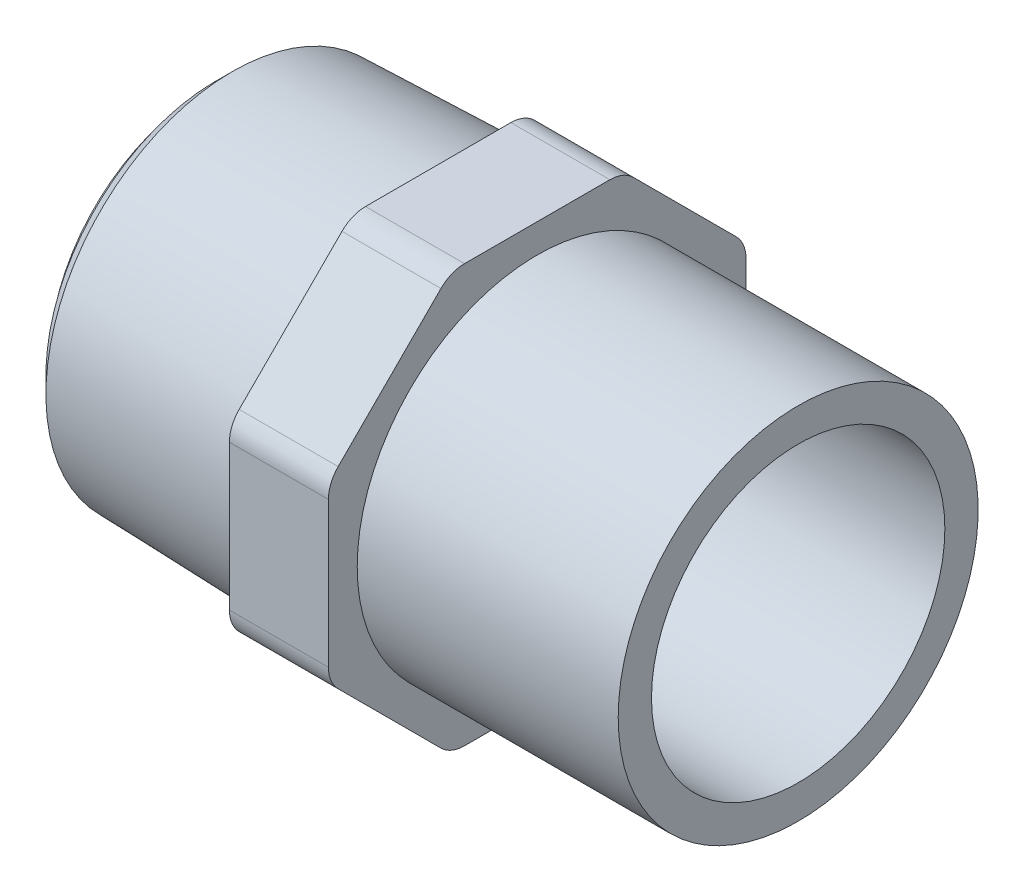
ISO-10303-21;
HEADER;
FILE_DESCRIPTION(('STEP AP214'),'2;1');
FILE_NAME('part.step','',(''),(''),'','','');
FILE_SCHEMA(('AUTOMOTIVE_DESIGN { 1 0 10303 214 1 1 1 1 }'));
ENDSEC;
DATA;
#1=APPLICATION_CONTEXT('core data for automotive mechanical design processes');
#2=APPLICATION_PROTOCOL_DEFINITION('international standard','automotive_design',2000,#1);
#3=PRODUCT_CONTEXT('',#1,'mechanical');
#4=PRODUCT('Part','Part','',(#3));
#5=PRODUCT_RELATED_PRODUCT_CATEGORY('part','',(#4));
#6=PRODUCT_DEFINITION_FORMATION('','',#4);
#7=PRODUCT_DEFINITION_CONTEXT('part definition',#1,'design');
#8=PRODUCT_DEFINITION('design','',#6,#7);
#9=PRODUCT_DEFINITION_SHAPE('','',#8);
#10=(LENGTH_UNIT() NAMED_UNIT(*) SI_UNIT(.MILLI.,.METRE.));
#11=(NAMED_UNIT(*) PLANE_ANGLE_UNIT() SI_UNIT($,.RADIAN.));
#12=(NAMED_UNIT(*) SI_UNIT($,.STERADIAN.) SOLID_ANGLE_UNIT());
#13=UNCERTAINTY_MEASURE_WITH_UNIT(LENGTH_MEASURE(1.E-05),#10,'distance_accuracy_value','');
#14=(GEOMETRIC_REPRESENTATION_CONTEXT(3) GLOBAL_UNCERTAINTY_ASSIGNED_CONTEXT((#13)) GLOBAL_UNIT_ASSIGNED_CONTEXT((#10,
#11,#12)) REPRESENTATION_CONTEXT('',''));
#15=CARTESIAN_POINT('',(0.,0.,0.));
#16=DIRECTION('',(0.,0.,1.));
#17=DIRECTION('',(1.,0.,0.));
#18=AXIS2_PLACEMENT_3D('',#15,#16,#17);
#19=CARTESIAN_POINT('',(-40.,-23.2,23.2));
#20=DIRECTION('',(-1.,0.,0.));
#21=DIRECTION('',(0.,1.,0.));
#22=AXIS2_PLACEMENT_3D('',#19,#20,#21);
#23=PLANE('',#22);
#24=CARTESIAN_POINT('',(-40.,0.,0.));
#25=DIRECTION('',(1.,0.,0.));
#26=DIRECTION('',(0.,0.,-1.));
#27=AXIS2_PLACEMENT_3D('',#24,#25,#26);
#28=CIRCLE('',#27,21.4293244783966);
#29=CARTESIAN_POINT('',(-40.,0.,-21.4293244783966));
#30=VERTEX_POINT('',#29);
#31=EDGE_CURVE('E18',#30,#30,#28,.F.);
#32=ORIENTED_EDGE('',*,*,#31,.F.);
#33=EDGE_LOOP('',(#32));
#34=FACE_BOUND('',#33,.T.);
#35=CARTESIAN_POINT('',(-40.,-19.5,8.07716446627534));
#36=DIRECTION('',(1.,0.,0.));
#37=DIRECTION('',(0.,0.,-1.));
#38=AXIS2_PLACEMENT_3D('',#35,#36,#37);
#39=CIRCLE('',#38,3.69999999999999);
#40=CARTESIAN_POINT('',(-40.,-22.1162950903902,10.6934595566656));
#41=VERTEX_POINT('',#40);
#42=CARTESIAN_POINT('',(-40.,-23.2,8.07716446627534));
#43=VERTEX_POINT('',#42);
#44=EDGE_CURVE('E235',#41,#43,#39,.T.);
#45=ORIENTED_EDGE('',*,*,#44,.F.);
#46=DIRECTION('',(0.,-0.707106781186547,-0.707106781186548));
#47=VECTOR('',#46,1.);
#48=CARTESIAN_POINT('',(-40.,-16.4048773235279,16.4048773235279));
#49=LINE('',#48,#47);
#50=CARTESIAN_POINT('',(-40.,-10.6934595566656,22.1162950903902));
#51=VERTEX_POINT('',#50);
#52=EDGE_CURVE('E132',#51,#41,#49,.T.);
#53=ORIENTED_EDGE('',*,*,#52,.F.);
#54=CARTESIAN_POINT('',(-40.,-8.07716446627536,19.5));
#55=DIRECTION('',(1.,0.,0.));
#56=DIRECTION('',(0.,0.,-1.));
#57=AXIS2_PLACEMENT_3D('',#54,#55,#56);
#58=CIRCLE('',#57,3.7);
#59=CARTESIAN_POINT('',(-40.,-8.07716446627536,23.2));
#60=VERTEX_POINT('',#59);
#61=EDGE_CURVE('E126',#60,#51,#58,.T.);
#62=ORIENTED_EDGE('',*,*,#61,.F.);
#63=DIRECTION('',(0.,-1.,0.));
#64=VECTOR('',#63,1.);
#65=CARTESIAN_POINT('',(-40.,0.,23.2));
#66=LINE('',#65,#64);
#67=CARTESIAN_POINT('',(-40.,8.07716446627536,23.2));
#68=VERTEX_POINT('',#67);
#69=EDGE_CURVE('E131',#68,#60,#66,.T.);
#70=ORIENTED_EDGE('',*,*,#69,.F.);
#71=CARTESIAN_POINT('',(-40.,8.07716446627537,19.5));
#72=DIRECTION('',(1.,0.,0.));
#73=DIRECTION('',(0.,0.,-1.));
#74=AXIS2_PLACEMENT_3D('',#71,#72,#73);
#75=CIRCLE('',#74,3.69999999999998);
#76=CARTESIAN_POINT('',(-40.,10.6934595566656,22.1162950903902));
#77=VERTEX_POINT('',#76);
#78=EDGE_CURVE('E147',#77,#68,#75,.T.);
#79=ORIENTED_EDGE('',*,*,#78,.F.);
#80=DIRECTION('',(0.,-0.707106781186548,0.707106781186548));
#81=VECTOR('',#80,1.);
#82=CARTESIAN_POINT('',(-40.,16.4048773235279,16.4048773235279));
#83=LINE('',#82,#81);
#84=CARTESIAN_POINT('',(-40.,22.1162950903902,10.6934595566656));
#85=VERTEX_POINT('',#84);
#86=EDGE_CURVE('E151',#85,#77,#83,.T.);
#87=ORIENTED_EDGE('',*,*,#86,.F.);
#88=CARTESIAN_POINT('',(-40.,19.5,8.07716446627536));
#89=DIRECTION('',(1.,0.,0.));
#90=DIRECTION('',(0.,0.,-1.));
#91=AXIS2_PLACEMENT_3D('',#88,#89,#90);
#92=CIRCLE('',#91,3.70000000000001);
#93=CARTESIAN_POINT('',(-40.,23.2,8.07716446627536));
#94=VERTEX_POINT('',#93);
#95=EDGE_CURVE('E225',#94,#85,#92,.T.);
#96=ORIENTED_EDGE('',*,*,#95,.F.);
#97=DIRECTION('',(0.,0.,1.));
#98=VECTOR('',#97,1.);
#99=CARTESIAN_POINT('',(-40.,23.2,0.));
#100=LINE('',#99,#98);
#101=CARTESIAN_POINT('',(-40.,23.2,-8.07716446627534));
#102=VERTEX_POINT('',#101);
#103=EDGE_CURVE('E155',#102,#94,#100,.T.);
#104=ORIENTED_EDGE('',*,*,#103,.F.);
#105=CARTESIAN_POINT('',(-40.,19.5,-8.07716446627534));
#106=DIRECTION('',(1.,0.,0.));
#107=DIRECTION('',(0.,0.,-1.));
#108=AXIS2_PLACEMENT_3D('',#105,#106,#107);
#109=CIRCLE('',#108,3.70000000000002);
#110=CARTESIAN_POINT('',(-40.,22.1162950903902,-10.6934595566656));
#111=VERTEX_POINT('',#110);
#112=EDGE_CURVE('E227',#111,#102,#109,.T.);
#113=ORIENTED_EDGE('',*,*,#112,.F.);
#114=DIRECTION('',(0.,0.707106781186548,0.707106781186548));
#115=VECTOR('',#114,1.);
#116=CARTESIAN_POINT('',(-40.,16.4048773235279,-16.4048773235279));
#117=LINE('',#116,#115);
#118=CARTESIAN_POINT('',(-40.,10.6934595566656,-22.1162950903902));
#119=VERTEX_POINT('',#118);
#120=EDGE_CURVE('E159',#119,#111,#117,.T.);
#121=ORIENTED_EDGE('',*,*,#120,.F.);
#122=CARTESIAN_POINT('',(-40.,8.07716446627538,-19.5));
#123=DIRECTION('',(1.,0.,0.));
#124=DIRECTION('',(0.,0.,-1.));
#125=AXIS2_PLACEMENT_3D('',#122,#123,#124);
#126=CIRCLE('',#125,3.69999999999995);
#127=CARTESIAN_POINT('',(-40.,8.07716446627537,-23.2));
#128=VERTEX_POINT('',#127);
#129=EDGE_CURVE('E229',#128,#119,#126,.T.);
#130=ORIENTED_EDGE('',*,*,#129,.F.);
#131=DIRECTION('',(0.,1.,0.));
#132=VECTOR('',#131,1.);
#133=CARTESIAN_POINT('',(-40.,0.,-23.2));
#134=LINE('',#133,#132);
#135=CARTESIAN_POINT('',(-40.,-8.07716446627535,-23.2));
#136=VERTEX_POINT('',#135);
#137=EDGE_CURVE('E163',#136,#128,#134,.T.);
#138=ORIENTED_EDGE('',*,*,#137,.F.);
#139=CARTESIAN_POINT('',(-40.,-8.07716446627535,-19.5));
#140=DIRECTION('',(1.,0.,0.));
#141=DIRECTION('',(0.,0.,-1.));
#142=AXIS2_PLACEMENT_3D('',#139,#140,#141);
#143=CIRCLE('',#142,3.7);
#144=CARTESIAN_POINT('',(-40.,-10.6934595566656,-22.1162950903902));
#145=VERTEX_POINT('',#144);
#146=EDGE_CURVE('E231',#145,#136,#143,.T.);
#147=ORIENTED_EDGE('',*,*,#146,.F.);
#148=DIRECTION('',(0.,0.707106781186548,-0.707106781186547));
#149=VECTOR('',#148,1.);
#150=CARTESIAN_POINT('',(-40.,-16.4048773235279,-16.4048773235279));
#151=LINE('',#150,#149);
#152=CARTESIAN_POINT('',(-40.,-22.1162950903902,-10.6934595566656));
#153=VERTEX_POINT('',#152);
#154=EDGE_CURVE('E167',#153,#145,#151,.T.);
#155=ORIENTED_EDGE('',*,*,#154,.F.);
#156=CARTESIAN_POINT('',(-40.,-19.5,-8.07716446627536));
#157=DIRECTION('',(1.,0.,0.));
#158=DIRECTION('',(0.,0.,-1.));
#159=AXIS2_PLACEMENT_3D('',#156,#157,#158);
#160=CIRCLE('',#159,3.7);
#161=CARTESIAN_POINT('',(-40.,-23.2,-8.07716446627536));
#162=VERTEX_POINT('',#161);
#163=EDGE_CURVE('E233',#162,#153,#160,.T.);
#164=ORIENTED_EDGE('',*,*,#163,.F.);
#165=DIRECTION('',(0.,0.,-1.));
#166=VECTOR('',#165,1.);
#167=CARTESIAN_POINT('',(-40.,-23.2,0.));
#168=LINE('',#167,#166);
#169=EDGE_CURVE('E171',#43,#162,#168,.T.);
#170=ORIENTED_EDGE('',*,*,#169,.F.);
#171=EDGE_LOOP('',(#45,#53,#62,#70,#79,#87,#96,#104,#113,#121,#130,#138,#147,#155,#164,#170));
#172=FACE_BOUND('',#171,.T.);
#173=ADVANCED_FACE('F15',(#34,#172),#23,.T.);
#174=CARTESIAN_POINT('',(-62.8730979570329,0.,0.));
#175=DIRECTION('',(1.,0.,0.));
#176=DIRECTION('',(0.,0.,-1.));
#177=AXIS2_PLACEMENT_3D('',#174,#175,#176);
#178=CONICAL_SURFACE('',#177,20.7169020429671,0.0311366738555787);
#179=CARTESIAN_POINT('',(-62.8730979570329,0.,0.));
#180=DIRECTION('',(-1.,0.,0.));
#181=DIRECTION('',(0.,1.,0.));
#182=AXIS2_PLACEMENT_3D('',#179,#180,#181);
#183=CIRCLE('',#182,20.7169020429671);
#184=CARTESIAN_POINT('',(-62.8730979570329,20.7169020429671,0.));
#185=VERTEX_POINT('',#184);
#186=EDGE_CURVE('E143',#185,#185,#183,.T.);
#187=ORIENTED_EDGE('',*,*,#186,.F.);
#188=EDGE_LOOP('',(#187));
#189=FACE_BOUND('',#188,.T.);
#190=ORIENTED_EDGE('',*,*,#31,.T.);
#191=EDGE_LOOP('',(#190));
#192=FACE_BOUND('',#191,.T.);
#193=ADVANCED_FACE('F537',(#189,#192),#178,.T.);
#194=CARTESIAN_POINT('',(-29.,-8.07716446627536,19.5));
#195=DIRECTION('',(1.,0.,0.));
#196=DIRECTION('',(0.,0.,-1.));
#197=AXIS2_PLACEMENT_3D('',#194,#195,#196);
#198=CYLINDRICAL_SURFACE('',#197,3.7);
#199=ORIENTED_EDGE('',*,*,#61,.T.);
#200=DIRECTION('',(1.,0.,0.));
#201=VECTOR('',#200,1.);
#202=CARTESIAN_POINT('',(-40.,-10.6934595566656,22.1162950903902));
#203=LINE('',#202,#201);
#204=CARTESIAN_POINT('',(-29.,-10.6934595566656,22.1162950903902));
#205=VERTEX_POINT('',#204);
#206=EDGE_CURVE('E135',#205,#51,#203,.F.);
#207=ORIENTED_EDGE('',*,*,#206,.F.);
#208=CARTESIAN_POINT('',(-29.,-8.07716446627536,19.5));
#209=DIRECTION('',(1.,0.,0.));
#210=DIRECTION('',(0.,0.,-1.));
#211=AXIS2_PLACEMENT_3D('',#208,#209,#210);
#212=CIRCLE('',#211,3.7);
#213=CARTESIAN_POINT('',(-29.,-8.07716446627536,23.2));
#214=VERTEX_POINT('',#213);
#215=EDGE_CURVE('E140',#214,#205,#212,.T.);
#216=ORIENTED_EDGE('',*,*,#215,.F.);
#217=DIRECTION('',(1.,0.,0.));
#218=VECTOR('',#217,1.);
#219=CARTESIAN_POINT('',(-40.,-8.07716446627536,23.2));
#220=LINE('',#219,#218);
#221=EDGE_CURVE('E137',#60,#214,#220,.T.);
#222=ORIENTED_EDGE('',*,*,#221,.F.);
#223=EDGE_LOOP('',(#199,#207,#216,#222));
#224=FACE_BOUND('',#223,.T.);
#225=ADVANCED_FACE('F138',(#224),#198,.T.);
#226=CARTESIAN_POINT('',(-40.,-10.6934595566656,22.1162950903902));
#227=DIRECTION('',(0.,-0.707106781186548,0.707106781186547));
#228=DIRECTION('',(0.,-0.707106781186547,-0.707106781186548));
#229=AXIS2_PLACEMENT_3D('',#226,#227,#228);
#230=PLANE('',#229);
#231=ORIENTED_EDGE('',*,*,#52,.T.);
#232=DIRECTION('',(-1.,0.,0.));
#233=VECTOR('',#232,1.);
#234=CARTESIAN_POINT('',(-34.5,-22.1162950903902,10.6934595566656));
#235=LINE('',#234,#233);
#236=CARTESIAN_POINT('',(-29.,-22.1162950903902,10.6934595566656));
#237=VERTEX_POINT('',#236);
#238=EDGE_CURVE('E175',#237,#41,#235,.T.);
#239=ORIENTED_EDGE('',*,*,#238,.F.);
#240=CARTESIAN_POINT('',(-29.,-10.6934595566656,22.1162950903902));
#241=CARTESIAN_POINT('',(-29.,-11.1694110372375,21.6403436098184));
#242=CARTESIAN_POINT('',(-29.,-11.6453625178093,21.1643921292465));
#243=CARTESIAN_POINT('',(-29.,-12.597265478953,20.2124891681028));
#244=CARTESIAN_POINT('',(-29.,-13.0732169595249,19.7365376875309));
#245=CARTESIAN_POINT('',(-29.,-14.0251199206686,18.7846347263872));
#246=CARTESIAN_POINT('',(-29.,-14.5010714012405,18.3086832458153));
#247=CARTESIAN_POINT('',(-29.,-15.4529743623842,17.3567802846716));
#248=CARTESIAN_POINT('',(-29.,-15.928925842956,16.8808288040998));
#249=CARTESIAN_POINT('',(-29.,-16.8808288040998,15.928925842956));
#250=CARTESIAN_POINT('',(-29.,-17.3567802846716,15.4529743623842));
#251=CARTESIAN_POINT('',(-29.,-18.3086832458153,14.5010714012405));
#252=CARTESIAN_POINT('',(-29.,-18.7846347263872,14.0251199206686));
#253=CARTESIAN_POINT('',(-29.,-19.7365376875309,13.0732169595249));
#254=CARTESIAN_POINT('',(-29.,-20.2124891681028,12.597265478953));
#255=CARTESIAN_POINT('',(-29.,-21.1643921292465,11.6453625178093));
#256=CARTESIAN_POINT('',(-29.,-21.6403436098184,11.1694110372374));
#257=CARTESIAN_POINT('',(-29.,-22.1162950903902,10.6934595566656));
#258=B_SPLINE_CURVE_WITH_KNOTS('',3,(#240,#241,#242,#243,#244,#245,#246,#247,#248,#249,#250,
#251,#252,#253,#254,#255,#256,#257),.UNSPECIFIED.,.F.,.F.,(4,2,2,2,2,2,2,2,4),(0.,
2.01929111656884,4.03858223313768,6.05787334970652,8.07716446627535,10.0964555828442,
12.115746699413,14.1350378159819,16.1543289325507),.UNSPECIFIED.);
#259=EDGE_CURVE('E222',#205,#237,#258,.T.);
#260=ORIENTED_EDGE('',*,*,#259,.F.);
#261=ORIENTED_EDGE('',*,*,#206,.T.);
#262=EDGE_LOOP('',(#231,#239,#260,#261));
#263=FACE_BOUND('',#262,.T.);
#264=ADVANCED_FACE('F369',(#263),#230,.T.);
#265=CARTESIAN_POINT('',(-29.,-19.5,8.07716446627534));
#266=DIRECTION('',(1.,0.,0.));
#267=DIRECTION('',(0.,0.,-1.));
#268=AXIS2_PLACEMENT_3D('',#265,#266,#267);
#269=CYLINDRICAL_SURFACE('',#268,3.69999999999999);
#270=ORIENTED_EDGE('',*,*,#44,.T.);
#271=DIRECTION('',(1.,0.,0.));
#272=VECTOR('',#271,1.);
#273=CARTESIAN_POINT('',(-40.,-23.2,8.07716446627535));
#274=LINE('',#273,#272);
#275=CARTESIAN_POINT('',(-29.,-23.2,8.07716446627535));
#276=VERTEX_POINT('',#275);
#277=EDGE_CURVE('E174',#276,#43,#274,.F.);
#278=ORIENTED_EDGE('',*,*,#277,.F.);
#279=CARTESIAN_POINT('',(-29.,-19.5,8.07716446627534));
#280=DIRECTION('',(1.,0.,0.));
#281=DIRECTION('',(0.,0.,-1.));
#282=AXIS2_PLACEMENT_3D('',#279,#280,#281);
#283=CIRCLE('',#282,3.69999999999999);
#284=EDGE_CURVE('E219',#237,#276,#283,.T.);
#285=ORIENTED_EDGE('',*,*,#284,.F.);
#286=ORIENTED_EDGE('',*,*,#238,.T.);
#287=EDGE_LOOP('',(#270,#278,#285,#286));
#288=FACE_BOUND('',#287,.T.);
#289=ADVANCED_FACE('F370',(#288),#269,.T.);
#290=CARTESIAN_POINT('',(-40.,-23.2,8.07716446627535));
#291=DIRECTION('',(0.,-1.,0.));
#292=DIRECTION('',(0.,0.,-1.));
#293=AXIS2_PLACEMENT_3D('',#290,#291,#292);
#294=PLANE('',#293);
#295=ORIENTED_EDGE('',*,*,#169,.T.);
#296=DIRECTION('',(-1.,0.,0.));
#297=VECTOR('',#296,1.);
#298=CARTESIAN_POINT('',(-34.5,-23.2,-8.07716446627536));
#299=LINE('',#298,#297);
#300=CARTESIAN_POINT('',(-29.,-23.2,-8.07716446627536));
#301=VERTEX_POINT('',#300);
#302=EDGE_CURVE('E173',#301,#162,#299,.T.);
#303=ORIENTED_EDGE('',*,*,#302,.F.);
#304=DIRECTION('',(0.,0.,-1.));
#305=VECTOR('',#304,1.);
#306=CARTESIAN_POINT('',(-29.,-23.2,23.2));
#307=LINE('',#306,#305);
#308=EDGE_CURVE('E218',#276,#301,#307,.T.);
#309=ORIENTED_EDGE('',*,*,#308,.F.);
#310=ORIENTED_EDGE('',*,*,#277,.T.);
#311=EDGE_LOOP('',(#295,#303,#309,#310));
#312=FACE_BOUND('',#311,.T.);
#313=ADVANCED_FACE('F326',(#312),#294,.T.);
#314=CARTESIAN_POINT('',(-29.,-19.5,-8.07716446627536));
#315=DIRECTION('',(1.,0.,0.));
#316=DIRECTION('',(0.,0.,-1.));
#317=AXIS2_PLACEMENT_3D('',#314,#315,#316);
#318=CYLINDRICAL_SURFACE('',#317,3.7);
#319=ORIENTED_EDGE('',*,*,#163,.T.);
#320=DIRECTION('',(1.,0.,0.));
#321=VECTOR('',#320,1.);
#322=CARTESIAN_POINT('',(-40.,-22.1162950903902,-10.6934595566656));
#323=LINE('',#322,#321);
#324=CARTESIAN_POINT('',(-29.,-22.1162950903902,-10.6934595566656));
#325=VERTEX_POINT('',#324);
#326=EDGE_CURVE('E170',#325,#153,#323,.F.);
#327=ORIENTED_EDGE('',*,*,#326,.F.);
#328=CARTESIAN_POINT('',(-29.,-19.5,-8.07716446627536));
#329=DIRECTION('',(1.,0.,0.));
#330=DIRECTION('',(0.,0.,-1.));
#331=AXIS2_PLACEMENT_3D('',#328,#329,#330);
#332=CIRCLE('',#331,3.7);
#333=EDGE_CURVE('E215',#301,#325,#332,.T.);
#334=ORIENTED_EDGE('',*,*,#333,.F.);
#335=ORIENTED_EDGE('',*,*,#302,.T.);
#336=EDGE_LOOP('',(#319,#327,#334,#335));
#337=FACE_BOUND('',#336,.T.);
#338=ADVANCED_FACE('F329',(#337),#318,.T.);
#339=CARTESIAN_POINT('',(-40.,-22.1162950903902,-10.6934595566656));
#340=DIRECTION('',(0.,-0.707106781186547,-0.707106781186548));
#341=DIRECTION('',(0.,0.707106781186548,-0.707106781186547));
#342=AXIS2_PLACEMENT_3D('',#339,#340,#341);
#343=PLANE('',#342);
#344=ORIENTED_EDGE('',*,*,#154,.T.);
#345=DIRECTION('',(-1.,0.,0.));
#346=VECTOR('',#345,1.);
#347=CARTESIAN_POINT('',(-34.5,-10.6934595566656,-22.1162950903902));
#348=LINE('',#347,#346);
#349=CARTESIAN_POINT('',(-29.,-10.6934595566656,-22.1162950903902));
#350=VERTEX_POINT('',#349);
#351=EDGE_CURVE('E169',#350,#145,#348,.T.);
#352=ORIENTED_EDGE('',*,*,#351,.F.);
#353=CARTESIAN_POINT('',(-29.,-22.1162950903902,-10.6934595566656));
#354=CARTESIAN_POINT('',(-29.,-21.6403436098184,-11.1694110372374));
#355=CARTESIAN_POINT('',(-29.,-21.1643921292465,-11.6453625178093));
#356=CARTESIAN_POINT('',(-29.,-20.2124891681028,-12.597265478953));
#357=CARTESIAN_POINT('',(-29.,-19.7365376875309,-13.0732169595249));
#358=CARTESIAN_POINT('',(-29.,-18.7846347263872,-14.0251199206686));
#359=CARTESIAN_POINT('',(-29.,-18.3086832458153,-14.5010714012405));
#360=CARTESIAN_POINT('',(-29.,-17.3567802846716,-15.4529743623842));
#361=CARTESIAN_POINT('',(-29.,-16.8808288040998,-15.9289258429561));
#362=CARTESIAN_POINT('',(-29.,-15.928925842956,-16.8808288040998));
#363=CARTESIAN_POINT('',(-29.,-15.4529743623842,-17.3567802846716));
#364=CARTESIAN_POINT('',(-29.,-14.5010714012405,-18.3086832458153));
#365=CARTESIAN_POINT('',(-29.,-14.0251199206686,-18.7846347263872));
#366=CARTESIAN_POINT('',(-29.,-13.0732169595249,-19.7365376875309));
#367=CARTESIAN_POINT('',(-29.,-12.597265478953,-20.2124891681028));
#368=CARTESIAN_POINT('',(-29.,-11.6453625178093,-21.1643921292465));
#369=CARTESIAN_POINT('',(-29.,-11.1694110372374,-21.6403436098184));
#370=CARTESIAN_POINT('',(-29.,-10.6934595566656,-22.1162950903902));
#371=B_SPLINE_CURVE_WITH_KNOTS('',3,(#353,#354,#355,#356,#357,#358,#359,#360,#361,#362,#363,
#364,#365,#366,#367,#368,#369,#370),.UNSPECIFIED.,.F.,.F.,(4,2,2,2,2,2,2,2,4),(0.,
2.01929111656884,4.03858223313768,6.05787334970651,8.07716446627535,10.0964555828442,
12.115746699413,14.1350378159819,16.1543289325507),.UNSPECIFIED.);
#372=EDGE_CURVE('E214',#325,#350,#371,.T.);
#373=ORIENTED_EDGE('',*,*,#372,.F.);
#374=ORIENTED_EDGE('',*,*,#326,.T.);
#375=EDGE_LOOP('',(#344,#352,#373,#374));
#376=FACE_BOUND('',#375,.T.);
#377=ADVANCED_FACE('F333',(#376),#343,.T.);
#378=CARTESIAN_POINT('',(-29.,-8.07716446627535,-19.5));
#379=DIRECTION('',(1.,0.,0.));
#380=DIRECTION('',(0.,0.,-1.));
#381=AXIS2_PLACEMENT_3D('',#378,#379,#380);
#382=CYLINDRICAL_SURFACE('',#381,3.7);
#383=ORIENTED_EDGE('',*,*,#146,.T.);
#384=DIRECTION('',(1.,0.,0.));
#385=VECTOR('',#384,1.);
#386=CARTESIAN_POINT('',(-40.,-8.07716446627535,-23.2));
#387=LINE('',#386,#385);
#388=CARTESIAN_POINT('',(-29.,-8.07716446627535,-23.2));
#389=VERTEX_POINT('',#388);
#390=EDGE_CURVE('E166',#389,#136,#387,.F.);
#391=ORIENTED_EDGE('',*,*,#390,.F.);
#392=CARTESIAN_POINT('',(-29.,-8.07716446627535,-19.5));
#393=DIRECTION('',(1.,0.,0.));
#394=DIRECTION('',(0.,0.,-1.));
#395=AXIS2_PLACEMENT_3D('',#392,#393,#394);
#396=CIRCLE('',#395,3.7);
#397=EDGE_CURVE('E211',#350,#389,#396,.T.);
#398=ORIENTED_EDGE('',*,*,#397,.F.);
#399=ORIENTED_EDGE('',*,*,#351,.T.);
#400=EDGE_LOOP('',(#383,#391,#398,#399));
#401=FACE_BOUND('',#400,.T.);
#402=ADVANCED_FACE('F337',(#401),#382,.T.);
#403=CARTESIAN_POINT('',(-40.,-8.07716446627535,-23.2));
#404=DIRECTION('',(0.,0.,-1.));
#405=DIRECTION('',(0.,1.,0.));
#406=AXIS2_PLACEMENT_3D('',#403,#404,#405);
#407=PLANE('',#406);
#408=ORIENTED_EDGE('',*,*,#137,.T.);
#409=DIRECTION('',(-1.,0.,0.));
#410=VECTOR('',#409,1.);
#411=CARTESIAN_POINT('',(-34.5,8.07716446627536,-23.2));
#412=LINE('',#411,#410);
#413=CARTESIAN_POINT('',(-29.,8.07716446627537,-23.2));
#414=VERTEX_POINT('',#413);
#415=EDGE_CURVE('E165',#414,#128,#412,.T.);
#416=ORIENTED_EDGE('',*,*,#415,.F.);
#417=DIRECTION('',(0.,1.,0.));
#418=VECTOR('',#417,1.);
#419=CARTESIAN_POINT('',(-29.,0.,-23.2));
#420=LINE('',#419,#418);
#421=EDGE_CURVE('E210',#389,#414,#420,.T.);
#422=ORIENTED_EDGE('',*,*,#421,.F.);
#423=ORIENTED_EDGE('',*,*,#390,.T.);
#424=EDGE_LOOP('',(#408,#416,#422,#423));
#425=FACE_BOUND('',#424,.T.);
#426=ADVANCED_FACE('F341',(#425),#407,.T.);
#427=CARTESIAN_POINT('',(-29.,8.07716446627538,-19.5));
#428=DIRECTION('',(1.,0.,0.));
#429=DIRECTION('',(0.,0.,-1.));
#430=AXIS2_PLACEMENT_3D('',#427,#428,#429);
#431=CYLINDRICAL_SURFACE('',#430,3.69999999999995);
#432=ORIENTED_EDGE('',*,*,#129,.T.);
#433=DIRECTION('',(1.,0.,0.));
#434=VECTOR('',#433,1.);
#435=CARTESIAN_POINT('',(-40.,10.6934595566656,-22.1162950903902));
#436=LINE('',#435,#434);
#437=CARTESIAN_POINT('',(-29.,10.6934595566656,-22.1162950903902));
#438=VERTEX_POINT('',#437);
#439=EDGE_CURVE('E162',#438,#119,#436,.F.);
#440=ORIENTED_EDGE('',*,*,#439,.F.);
#441=CARTESIAN_POINT('',(-29.,8.07716446627538,-19.5));
#442=DIRECTION('',(1.,0.,0.));
#443=DIRECTION('',(0.,0.,-1.));
#444=AXIS2_PLACEMENT_3D('',#441,#442,#443);
#445=CIRCLE('',#444,3.69999999999995);
#446=EDGE_CURVE('E207',#414,#438,#445,.T.);
#447=ORIENTED_EDGE('',*,*,#446,.F.);
#448=ORIENTED_EDGE('',*,*,#415,.T.);
#449=EDGE_LOOP('',(#432,#440,#447,#448));
#450=FACE_BOUND('',#449,.T.);
#451=ADVANCED_FACE('F345',(#450),#431,.T.);
#452=CARTESIAN_POINT('',(-40.,10.6934595566656,-22.1162950903902));
#453=DIRECTION('',(0.,0.707106781186547,-0.707106781186547));
#454=DIRECTION('',(0.,0.707106781186547,0.707106781186547));
#455=AXIS2_PLACEMENT_3D('',#452,#453,#454);
#456=PLANE('',#455);
#457=ORIENTED_EDGE('',*,*,#120,.T.);
#458=DIRECTION('',(-1.,0.,0.));
#459=VECTOR('',#458,1.);
#460=CARTESIAN_POINT('',(-34.5,22.1162950903902,-10.6934595566656));
#461=LINE('',#460,#459);
#462=CARTESIAN_POINT('',(-29.,22.1162950903902,-10.6934595566656));
#463=VERTEX_POINT('',#462);
#464=EDGE_CURVE('E161',#463,#111,#461,.T.);
#465=ORIENTED_EDGE('',*,*,#464,.F.);
#466=CARTESIAN_POINT('',(-29.,10.6934595566656,-22.1162950903902));
#467=CARTESIAN_POINT('',(-29.,11.1694110372374,-21.6403436098184));
#468=CARTESIAN_POINT('',(-29.,11.6453625178093,-21.1643921292465));
#469=CARTESIAN_POINT('',(-29.,12.597265478953,-20.2124891681028));
#470=CARTESIAN_POINT('',(-29.,13.0732169595249,-19.7365376875309));
#471=CARTESIAN_POINT('',(-29.,14.0251199206686,-18.7846347263872));
#472=CARTESIAN_POINT('',(-29.,14.5010714012405,-18.3086832458153));
#473=CARTESIAN_POINT('',(-29.,15.4529743623842,-17.3567802846716));
#474=CARTESIAN_POINT('',(-29.,15.928925842956,-16.8808288040998));
#475=CARTESIAN_POINT('',(-29.,16.8808288040998,-15.928925842956));
#476=CARTESIAN_POINT('',(-29.,17.3567802846716,-15.4529743623842));
#477=CARTESIAN_POINT('',(-29.,18.3086832458153,-14.5010714012405));
#478=CARTESIAN_POINT('',(-29.,18.7846347263872,-14.0251199206686));
#479=CARTESIAN_POINT('',(-29.,19.7365376875309,-13.0732169595249));
#480=CARTESIAN_POINT('',(-29.,20.2124891681028,-12.597265478953));
#481=CARTESIAN_POINT('',(-29.,21.1643921292465,-11.6453625178093));
#482=CARTESIAN_POINT('',(-29.,21.6403436098184,-11.1694110372374));
#483=CARTESIAN_POINT('',(-29.,22.1162950903902,-10.6934595566656));
#484=B_SPLINE_CURVE_WITH_KNOTS('',3,(#466,#467,#468,#469,#470,#471,#472,#473,#474,#475,#476,
#477,#478,#479,#480,#481,#482,#483),.UNSPECIFIED.,.F.,.F.,(4,2,2,2,2,2,2,2,4),(0.,
2.01929111656884,4.03858223313768,6.05787334970652,8.07716446627535,10.0964555828442,
12.115746699413,14.1350378159819,16.1543289325507),.UNSPECIFIED.);
#485=EDGE_CURVE('E206',#438,#463,#484,.T.);
#486=ORIENTED_EDGE('',*,*,#485,.F.);
#487=ORIENTED_EDGE('',*,*,#439,.T.);
#488=EDGE_LOOP('',(#457,#465,#486,#487));
#489=FACE_BOUND('',#488,.T.);
#490=ADVANCED_FACE('F349',(#489),#456,.T.);
#491=CARTESIAN_POINT('',(-29.,19.5,-8.07716446627534));
#492=DIRECTION('',(1.,0.,0.));
#493=DIRECTION('',(0.,0.,-1.));
#494=AXIS2_PLACEMENT_3D('',#491,#492,#493);
#495=CYLINDRICAL_SURFACE('',#494,3.70000000000002);
#496=ORIENTED_EDGE('',*,*,#112,.T.);
#497=DIRECTION('',(1.,0.,0.));
#498=VECTOR('',#497,1.);
#499=CARTESIAN_POINT('',(-40.,23.2,-8.07716446627534));
#500=LINE('',#499,#498);
#501=CARTESIAN_POINT('',(-29.,23.2,-8.07716446627534));
#502=VERTEX_POINT('',#501);
#503=EDGE_CURVE('E158',#502,#102,#500,.F.);
#504=ORIENTED_EDGE('',*,*,#503,.F.);
#505=CARTESIAN_POINT('',(-29.,19.5,-8.07716446627534));
#506=DIRECTION('',(1.,0.,0.));
#507=DIRECTION('',(0.,0.,-1.));
#508=AXIS2_PLACEMENT_3D('',#505,#506,#507);
#509=CIRCLE('',#508,3.70000000000002);
#510=EDGE_CURVE('E203',#463,#502,#509,.T.);
#511=ORIENTED_EDGE('',*,*,#510,.F.);
#512=ORIENTED_EDGE('',*,*,#464,.T.);
#513=EDGE_LOOP('',(#496,#504,#511,#512));
#514=FACE_BOUND('',#513,.T.);
#515=ADVANCED_FACE('F353',(#514),#495,.T.);
#516=CARTESIAN_POINT('',(-40.,23.2,-8.07716446627534));
#517=DIRECTION('',(0.,1.,0.));
#518=DIRECTION('',(0.,0.,1.));
#519=AXIS2_PLACEMENT_3D('',#516,#517,#518);
#520=PLANE('',#519);
#521=ORIENTED_EDGE('',*,*,#103,.T.);
#522=DIRECTION('',(-1.,0.,0.));
#523=VECTOR('',#522,1.);
#524=CARTESIAN_POINT('',(-34.5,23.2,8.07716446627536));
#525=LINE('',#524,#523);
#526=CARTESIAN_POINT('',(-29.,23.2,8.07716446627536));
#527=VERTEX_POINT('',#526);
#528=EDGE_CURVE('E157',#527,#94,#525,.T.);
#529=ORIENTED_EDGE('',*,*,#528,.F.);
#530=DIRECTION('',(0.,0.,-1.));
#531=VECTOR('',#530,1.);
#532=CARTESIAN_POINT('',(-29.,23.2,23.2));
#533=LINE('',#532,#531);
#534=EDGE_CURVE('E202',#502,#527,#533,.F.);
#535=ORIENTED_EDGE('',*,*,#534,.F.);
#536=ORIENTED_EDGE('',*,*,#503,.T.);
#537=EDGE_LOOP('',(#521,#529,#535,#536));
#538=FACE_BOUND('',#537,.T.);
#539=ADVANCED_FACE('F357',(#538),#520,.T.);
#540=CARTESIAN_POINT('',(-29.,19.5,8.07716446627536));
#541=DIRECTION('',(1.,0.,0.));
#542=DIRECTION('',(0.,0.,-1.));
#543=AXIS2_PLACEMENT_3D('',#540,#541,#542);
#544=CYLINDRICAL_SURFACE('',#543,3.70000000000001);
#545=ORIENTED_EDGE('',*,*,#95,.T.);
#546=DIRECTION('',(1.,0.,0.));
#547=VECTOR('',#546,1.);
#548=CARTESIAN_POINT('',(-40.,22.1162950903902,10.6934595566656));
#549=LINE('',#548,#547);
#550=CARTESIAN_POINT('',(-29.,22.1162950903902,10.6934595566656));
#551=VERTEX_POINT('',#550);
#552=EDGE_CURVE('E154',#551,#85,#549,.F.);
#553=ORIENTED_EDGE('',*,*,#552,.F.);
#554=CARTESIAN_POINT('',(-29.,19.5,8.07716446627536));
#555=DIRECTION('',(1.,0.,0.));
#556=DIRECTION('',(0.,0.,-1.));
#557=AXIS2_PLACEMENT_3D('',#554,#555,#556);
#558=CIRCLE('',#557,3.70000000000001);
#559=EDGE_CURVE('E199',#527,#551,#558,.T.);
#560=ORIENTED_EDGE('',*,*,#559,.F.);
#561=ORIENTED_EDGE('',*,*,#528,.T.);
#562=EDGE_LOOP('',(#545,#553,#560,#561));
#563=FACE_BOUND('',#562,.T.);
#564=ADVANCED_FACE('F361',(#563),#544,.T.);
#565=CARTESIAN_POINT('',(-40.,22.1162950903902,10.6934595566656));
#566=DIRECTION('',(0.,0.707106781186547,0.707106781186547));
#567=DIRECTION('',(0.,-0.707106781186547,0.707106781186547));
#568=AXIS2_PLACEMENT_3D('',#565,#566,#567);
#569=PLANE('',#568);
#570=ORIENTED_EDGE('',*,*,#86,.T.);
#571=DIRECTION('',(-1.,0.,0.));
#572=VECTOR('',#571,1.);
#573=CARTESIAN_POINT('',(-34.5,10.6934595566656,22.1162950903902));
#574=LINE('',#573,#572);
#575=CARTESIAN_POINT('',(-29.,10.6934595566656,22.1162950903902));
#576=VERTEX_POINT('',#575);
#577=EDGE_CURVE('E153',#576,#77,#574,.T.);
#578=ORIENTED_EDGE('',*,*,#577,.F.);
#579=CARTESIAN_POINT('',(-29.,22.1162950903902,10.6934595566656));
#580=CARTESIAN_POINT('',(-29.,21.6403436098184,11.1694110372374));
#581=CARTESIAN_POINT('',(-29.,21.1643921292465,11.6453625178093));
#582=CARTESIAN_POINT('',(-29.,20.2124891681028,12.597265478953));
#583=CARTESIAN_POINT('',(-29.,19.7365376875309,13.0732169595249));
#584=CARTESIAN_POINT('',(-29.,18.7846347263872,14.0251199206686));
#585=CARTESIAN_POINT('',(-29.,18.3086832458153,14.5010714012405));
#586=CARTESIAN_POINT('',(-29.,17.3567802846716,15.4529743623842));
#587=CARTESIAN_POINT('',(-29.,16.8808288040998,15.928925842956));
#588=CARTESIAN_POINT('',(-29.,15.928925842956,16.8808288040998));
#589=CARTESIAN_POINT('',(-29.,15.4529743623842,17.3567802846716));
#590=CARTESIAN_POINT('',(-29.,14.5010714012405,18.3086832458153));
#591=CARTESIAN_POINT('',(-29.,14.0251199206686,18.7846347263872));
#592=CARTESIAN_POINT('',(-29.,13.0732169595249,19.7365376875309));
#593=CARTESIAN_POINT('',(-29.,12.597265478953,20.2124891681028));
#594=CARTESIAN_POINT('',(-29.,11.6453625178093,21.1643921292465));
#595=CARTESIAN_POINT('',(-29.,11.1694110372375,21.6403436098184));
#596=CARTESIAN_POINT('',(-29.,10.6934595566656,22.1162950903902));
#597=B_SPLINE_CURVE_WITH_KNOTS('',3,(#579,#580,#581,#582,#583,#584,#585,#586,#587,#588,#589,
#590,#591,#592,#593,#594,#595,#596),.UNSPECIFIED.,.F.,.F.,(4,2,2,2,2,2,2,2,4),(0.,
2.01929111656884,4.03858223313768,6.05787334970652,8.07716446627535,10.0964555828442,
12.115746699413,14.1350378159819,16.1543289325507),.UNSPECIFIED.);
#598=EDGE_CURVE('E198',#551,#576,#597,.T.);
#599=ORIENTED_EDGE('',*,*,#598,.F.);
#600=ORIENTED_EDGE('',*,*,#552,.T.);
#601=EDGE_LOOP('',(#570,#578,#599,#600));
#602=FACE_BOUND('',#601,.T.);
#603=ADVANCED_FACE('F365',(#602),#569,.T.);
#604=CARTESIAN_POINT('',(-29.,8.07716446627537,19.5));
#605=DIRECTION('',(1.,0.,0.));
#606=DIRECTION('',(0.,0.,-1.));
#607=AXIS2_PLACEMENT_3D('',#604,#605,#606);
#608=CYLINDRICAL_SURFACE('',#607,3.69999999999998);
#609=ORIENTED_EDGE('',*,*,#78,.T.);
#610=DIRECTION('',(1.,0.,0.));
#611=VECTOR('',#610,1.);
#612=CARTESIAN_POINT('',(-40.,8.07716446627536,23.2));
#613=LINE('',#612,#611);
#614=CARTESIAN_POINT('',(-29.,8.07716446627536,23.2));
#615=VERTEX_POINT('',#614);
#616=EDGE_CURVE('E33',#615,#68,#613,.F.);
#617=ORIENTED_EDGE('',*,*,#616,.F.);
#618=CARTESIAN_POINT('',(-29.,8.07716446627537,19.5));
#619=DIRECTION('',(1.,0.,0.));
#620=DIRECTION('',(0.,0.,-1.));
#621=AXIS2_PLACEMENT_3D('',#618,#619,#620);
#622=CIRCLE('',#621,3.69999999999998);
#623=EDGE_CURVE('E195',#576,#615,#622,.T.);
#624=ORIENTED_EDGE('',*,*,#623,.F.);
#625=ORIENTED_EDGE('',*,*,#577,.T.);
#626=EDGE_LOOP('',(#609,#617,#624,#625));
#627=FACE_BOUND('',#626,.T.);
#628=ADVANCED_FACE('F366',(#627),#608,.T.);
#629=CARTESIAN_POINT('',(-40.,8.07716446627536,23.2));
#630=DIRECTION('',(0.,0.,1.));
#631=DIRECTION('',(0.,-1.,0.));
#632=AXIS2_PLACEMENT_3D('',#629,#630,#631);
#633=PLANE('',#632);
#634=ORIENTED_EDGE('',*,*,#69,.T.);
#635=ORIENTED_EDGE('',*,*,#221,.T.);
#636=DIRECTION('',(0.,-1.,0.));
#637=VECTOR('',#636,1.);
#638=CARTESIAN_POINT('',(-29.,0.,23.2));
#639=LINE('',#638,#637);
#640=EDGE_CURVE('E194',#615,#214,#639,.T.);
#641=ORIENTED_EDGE('',*,*,#640,.F.);
#642=ORIENTED_EDGE('',*,*,#616,.T.);
#643=EDGE_LOOP('',(#634,#635,#641,#642));
#644=FACE_BOUND('',#643,.T.);
#645=ADVANCED_FACE('F145',(#644),#633,.T.);
#646=CARTESIAN_POINT('',(-64.7,0.,0.));
#647=DIRECTION('',(1.,0.,0.));
#648=DIRECTION('',(0.,0.,-1.));
#649=AXIS2_PLACEMENT_3D('',#646,#647,#648);
#650=CONICAL_SURFACE('',#649,18.89,0.785398163397448);
#651=CARTESIAN_POINT('',(-64.7,0.,0.));
#652=DIRECTION('',(1.,0.,0.));
#653=DIRECTION('',(0.,0.,-1.));
#654=AXIS2_PLACEMENT_3D('',#651,#652,#653);
#655=CIRCLE('',#654,18.89);
#656=CARTESIAN_POINT('',(-64.7,0.,-18.89));
#657=VERTEX_POINT('',#656);
#658=EDGE_CURVE('E191',#657,#657,#655,.F.);
#659=ORIENTED_EDGE('',*,*,#658,.F.);
#660=EDGE_LOOP('',(#659));
#661=FACE_BOUND('',#660,.T.);
#662=ORIENTED_EDGE('',*,*,#186,.T.);
#663=EDGE_LOOP('',(#662));
#664=FACE_BOUND('',#663,.T.);
#665=ADVANCED_FACE('F412',(#661,#664),#650,.T.);
#666=CARTESIAN_POINT('',(-29.,23.2,23.2));
#667=DIRECTION('',(1.,0.,0.));
#668=DIRECTION('',(0.,-1.,0.));
#669=AXIS2_PLACEMENT_3D('',#666,#667,#668);
#670=PLANE('',#669);
#671=CARTESIAN_POINT('',(-29.,0.,0.));
#672=DIRECTION('',(-1.,0.,0.));
#673=DIRECTION('',(0.,0.,1.));
#674=AXIS2_PLACEMENT_3D('',#671,#672,#673);
#675=CIRCLE('',#674,20.);
#676=CARTESIAN_POINT('',(-29.,0.,20.));
#677=VERTEX_POINT('',#676);
#678=EDGE_CURVE('E188',#677,#677,#675,.F.);
#679=ORIENTED_EDGE('',*,*,#678,.F.);
#680=EDGE_LOOP('',(#679));
#681=FACE_BOUND('',#680,.T.);
#682=ORIENTED_EDGE('',*,*,#623,.T.);
#683=ORIENTED_EDGE('',*,*,#640,.T.);
#684=ORIENTED_EDGE('',*,*,#215,.T.);
#685=ORIENTED_EDGE('',*,*,#259,.T.);
#686=ORIENTED_EDGE('',*,*,#284,.T.);
#687=ORIENTED_EDGE('',*,*,#308,.T.);
#688=ORIENTED_EDGE('',*,*,#333,.T.);
#689=ORIENTED_EDGE('',*,*,#372,.T.);
#690=ORIENTED_EDGE('',*,*,#397,.T.);
#691=ORIENTED_EDGE('',*,*,#421,.T.);
#692=ORIENTED_EDGE('',*,*,#446,.T.);
#693=ORIENTED_EDGE('',*,*,#485,.T.);
#694=ORIENTED_EDGE('',*,*,#510,.T.);
#695=ORIENTED_EDGE('',*,*,#534,.T.);
#696=ORIENTED_EDGE('',*,*,#559,.T.);
#697=ORIENTED_EDGE('',*,*,#598,.T.);
#698=EDGE_LOOP('',(#682,#683,#684,#685,#686,#687,#688,#689,#690,#691,#692,#693,#694,#695,#696,#697));
#699=FACE_BOUND('',#698,.T.);
#700=ADVANCED_FACE('F260',(#681,#699),#670,.T.);
#701=CARTESIAN_POINT('',(-64.7,-18.89,19.1166821083373));
#702=DIRECTION('',(-1.,0.,0.));
#703=DIRECTION('',(0.,1.,0.));
#704=AXIS2_PLACEMENT_3D('',#701,#702,#703);
#705=PLANE('',#704);
#706=CARTESIAN_POINT('',(-64.7,0.,0.));
#707=DIRECTION('',(-1.,0.,0.));
#708=DIRECTION('',(0.,0.,1.));
#709=AXIS2_PLACEMENT_3D('',#706,#707,#708);
#710=CIRCLE('',#709,17.225);
#711=CARTESIAN_POINT('',(-64.7,0.,17.225));
#712=VERTEX_POINT('',#711);
#713=EDGE_CURVE('E185',#712,#712,#710,.T.);
#714=ORIENTED_EDGE('',*,*,#713,.F.);
#715=EDGE_LOOP('',(#714));
#716=FACE_BOUND('',#715,.T.);
#717=ORIENTED_EDGE('',*,*,#658,.T.);
#718=EDGE_LOOP('',(#717));
#719=FACE_BOUND('',#718,.T.);
#720=ADVANCED_FACE('F258',(#716,#719),#705,.T.);
#721=CARTESIAN_POINT('',(-29.,0.,0.));
#722=DIRECTION('',(-1.,0.,0.));
#723=DIRECTION('',(0.,0.,1.));
#724=AXIS2_PLACEMENT_3D('',#721,#722,#723);
#725=CYLINDRICAL_SURFACE('',#724,20.);
#726=ORIENTED_EDGE('',*,*,#678,.T.);
#727=EDGE_LOOP('',(#726));
#728=FACE_BOUND('',#727,.T.);
#729=CARTESIAN_POINT('',(0.,0.,0.));
#730=DIRECTION('',(-1.,0.,0.));
#731=DIRECTION('',(0.,0.,1.));
#732=AXIS2_PLACEMENT_3D('',#729,#730,#731);
#733=CIRCLE('',#732,20.);
#734=CARTESIAN_POINT('',(0.,0.,20.));
#735=VERTEX_POINT('',#734);
#736=EDGE_CURVE('E182',#735,#735,#733,.F.);
#737=ORIENTED_EDGE('',*,*,#736,.F.);
#738=EDGE_LOOP('',(#737));
#739=FACE_BOUND('',#738,.T.);
#740=ADVANCED_FACE('F398',(#728,#739),#725,.T.);
#741=CARTESIAN_POINT('',(-66.,0.,0.));
#742=DIRECTION('',(-1.,0.,0.));
#743=DIRECTION('',(0.,0.,1.));
#744=AXIS2_PLACEMENT_3D('',#741,#742,#743);
#745=CYLINDRICAL_SURFACE('',#744,17.225);
#746=CARTESIAN_POINT('',(-66.,0.,0.));
#747=DIRECTION('',(-1.,0.,0.));
#748=DIRECTION('',(0.,0.,1.));
#749=AXIS2_PLACEMENT_3D('',#746,#747,#748);
#750=CIRCLE('',#749,17.225);
#751=CARTESIAN_POINT('',(-66.,0.,17.225));
#752=VERTEX_POINT('',#751);
#753=EDGE_CURVE('E179',#752,#752,#750,.T.);
#754=ORIENTED_EDGE('',*,*,#753,.F.);
#755=EDGE_LOOP('',(#754));
#756=FACE_BOUND('',#755,.T.);
#757=ORIENTED_EDGE('',*,*,#713,.T.);
#758=EDGE_LOOP('',(#757));
#759=FACE_BOUND('',#758,.T.);
#760=ADVANCED_FACE('F395',(#756,#759),#745,.T.);
#761=CARTESIAN_POINT('',(0.,20.,20.2400021083974));
#762=DIRECTION('',(1.,0.,0.));
#763=DIRECTION('',(0.,-1.,0.));
#764=AXIS2_PLACEMENT_3D('',#761,#762,#763);
#765=PLANE('',#764);
#766=CARTESIAN_POINT('',(0.,0.,0.));
#767=DIRECTION('',(-1.,0.,0.));
#768=DIRECTION('',(0.,0.,1.));
#769=AXIS2_PLACEMENT_3D('',#766,#767,#768);
#770=CIRCLE('',#769,16.3);
#771=CARTESIAN_POINT('',(0.,0.,16.3));
#772=VERTEX_POINT('',#771);
#773=EDGE_CURVE('E24',#772,#772,#770,.F.);
#774=ORIENTED_EDGE('',*,*,#773,.F.);
#775=EDGE_LOOP('',(#774));
#776=FACE_BOUND('',#775,.T.);
#777=ORIENTED_EDGE('',*,*,#736,.T.);
#778=EDGE_LOOP('',(#777));
#779=FACE_BOUND('',#778,.T.);
#780=ADVANCED_FACE('F388',(#776,#779),#765,.T.);
#781=CARTESIAN_POINT('',(-66.,-17.225,17.4317021083002));
#782=DIRECTION('',(-1.,0.,0.));
#783=DIRECTION('',(0.,1.,0.));
#784=AXIS2_PLACEMENT_3D('',#781,#782,#783);
#785=PLANE('',#784);
#786=CARTESIAN_POINT('',(-66.,0.,0.));
#787=DIRECTION('',(-1.,0.,0.));
#788=DIRECTION('',(0.,0.,1.));
#789=AXIS2_PLACEMENT_3D('',#786,#787,#788);
#790=CIRCLE('',#789,16.3);
#791=CARTESIAN_POINT('',(-66.,0.,16.3));
#792=VERTEX_POINT('',#791);
#793=EDGE_CURVE('E9',#792,#792,#790,.T.);
#794=ORIENTED_EDGE('',*,*,#793,.F.);
#795=EDGE_LOOP('',(#794));
#796=FACE_BOUND('',#795,.T.);
#797=ORIENTED_EDGE('',*,*,#753,.T.);
#798=EDGE_LOOP('',(#797));
#799=FACE_BOUND('',#798,.T.);
#800=ADVANCED_FACE('F382',(#796,#799),#785,.T.);
#801=CARTESIAN_POINT('',(0.,0.,0.));
#802=DIRECTION('',(-1.,0.,0.));
#803=DIRECTION('',(0.,0.,1.));
#804=AXIS2_PLACEMENT_3D('',#801,#802,#803);
#805=CYLINDRICAL_SURFACE('',#804,16.3);
#806=ORIENTED_EDGE('',*,*,#773,.T.);
#807=EDGE_LOOP('',(#806));
#808=FACE_BOUND('',#807,.T.);
#809=ORIENTED_EDGE('',*,*,#793,.T.);
#810=EDGE_LOOP('',(#809));
#811=FACE_BOUND('',#810,.T.);
#812=ADVANCED_FACE('F380',(#808,#811),#805,.F.);
#813=CLOSED_SHELL('',(#173,#193,#225,#264,#289,#313,#338,#377,#402,#426,#451,#490,#515,#539,
#564,#603,#628,#645,#665,#700,#720,#740,#760,#780,#800,#812));
#814=MANIFOLD_SOLID_BREP('B1',#813);
#815=ADVANCED_BREP_SHAPE_REPRESENTATION('',(#18,#814),#14);
#816=SHAPE_DEFINITION_REPRESENTATION(#9,#815);
ENDSEC;
END-ISO-10303-21;
